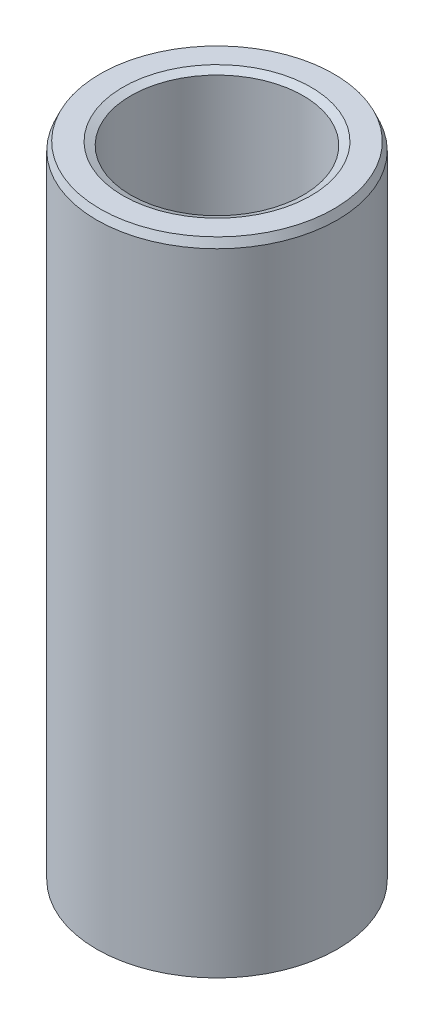
ISO-10303-21;
HEADER;
FILE_DESCRIPTION(('STEP AP214'),'2;1');
FILE_NAME('part.step','',(''),(''),'','','');
FILE_SCHEMA(('AUTOMOTIVE_DESIGN { 1 0 10303 214 1 1 1 1 }'));
ENDSEC;
DATA;
#1=APPLICATION_CONTEXT('core data for automotive mechanical design processes');
#2=APPLICATION_PROTOCOL_DEFINITION('international standard','automotive_design',2000,#1);
#3=PRODUCT_CONTEXT('',#1,'mechanical');
#4=PRODUCT('Part','Part','',(#3));
#5=PRODUCT_RELATED_PRODUCT_CATEGORY('part','',(#4));
#6=PRODUCT_DEFINITION_FORMATION('','',#4);
#7=PRODUCT_DEFINITION_CONTEXT('part definition',#1,'design');
#8=PRODUCT_DEFINITION('design','',#6,#7);
#9=PRODUCT_DEFINITION_SHAPE('','',#8);
#10=(LENGTH_UNIT() NAMED_UNIT(*) SI_UNIT(.MILLI.,.METRE.));
#11=(NAMED_UNIT(*) PLANE_ANGLE_UNIT() SI_UNIT($,.RADIAN.));
#12=(NAMED_UNIT(*) SI_UNIT($,.STERADIAN.) SOLID_ANGLE_UNIT());
#13=UNCERTAINTY_MEASURE_WITH_UNIT(LENGTH_MEASURE(1.E-05),#10,'distance_accuracy_value','');
#14=(GEOMETRIC_REPRESENTATION_CONTEXT(3) GLOBAL_UNCERTAINTY_ASSIGNED_CONTEXT((#13)) GLOBAL_UNIT_ASSIGNED_CONTEXT((#10,
#11,#12)) REPRESENTATION_CONTEXT('',''));
#15=CARTESIAN_POINT('',(0.,0.,0.));
#16=DIRECTION('',(0.,0.,1.));
#17=DIRECTION('',(1.,0.,0.));
#18=AXIS2_PLACEMENT_3D('',#15,#16,#17);
#19=CARTESIAN_POINT('',(0.,293.691769745959,0.));
#20=DIRECTION('',(0.,-1.,0.));
#21=DIRECTION('',(0.,0.,-1.));
#22=AXIS2_PLACEMENT_3D('',#19,#20,#21);
#23=CYLINDRICAL_SURFACE('',#22,55.);
#24=CARTESIAN_POINT('',(0.,1.58074699449356,0.));
#25=DIRECTION('',(0.,1.,0.));
#26=DIRECTION('',(0.,0.,1.));
#27=AXIS2_PLACEMENT_3D('',#24,#25,#26);
#28=CIRCLE('',#27,55.);
#29=CARTESIAN_POINT('',(0.,1.58074699449356,55.));
#30=VERTEX_POINT('',#29);
#31=EDGE_CURVE('E10',#30,#30,#28,.T.);
#32=ORIENTED_EDGE('',*,*,#31,.T.);
#33=EDGE_LOOP('',(#32));
#34=FACE_BOUND('',#33,.T.);
#35=CARTESIAN_POINT('',(0.,290.095074646584,0.));
#36=DIRECTION('',(0.,1.,0.));
#37=DIRECTION('',(0.,0.,1.));
#38=AXIS2_PLACEMENT_3D('',#35,#36,#37);
#39=CIRCLE('',#38,55.);
#40=CARTESIAN_POINT('',(0.,290.095074646584,55.));
#41=VERTEX_POINT('',#40);
#42=EDGE_CURVE('E50',#41,#41,#39,.F.);
#43=ORIENTED_EDGE('',*,*,#42,.T.);
#44=EDGE_LOOP('',(#43));
#45=FACE_BOUND('',#44,.T.);
#46=ADVANCED_FACE('F39',(#34,#45),#23,.T.);
#47=CARTESIAN_POINT('',(0.,293.691769745959,0.));
#48=DIRECTION('',(0.,1.,0.));
#49=DIRECTION('',(0.,0.,1.));
#50=AXIS2_PLACEMENT_3D('',#47,#48,#49);
#51=PLANE('',#50);
#52=CARTESIAN_POINT('',(0.,293.691769745959,0.));
#53=DIRECTION('',(0.,1.,0.));
#54=DIRECTION('',(0.,0.,1.));
#55=AXIS2_PLACEMENT_3D('',#52,#53,#54);
#56=CIRCLE('',#55,42.9624006531695);
#57=CARTESIAN_POINT('',(0.,293.691769745959,42.9624006531695));
#58=VERTEX_POINT('',#57);
#59=EDGE_CURVE('E58',#58,#58,#56,.F.);
#60=ORIENTED_EDGE('',*,*,#59,.T.);
#61=EDGE_LOOP('',(#60));
#62=FACE_BOUND('',#61,.T.);
#63=CARTESIAN_POINT('',(0.,293.691769745959,0.));
#64=DIRECTION('',(0.,1.,0.));
#65=DIRECTION('',(0.,0.,1.));
#66=AXIS2_PLACEMENT_3D('',#63,#64,#65);
#67=CIRCLE('',#66,53.4192530055064);
#68=CARTESIAN_POINT('',(0.,293.691769745959,53.4192530055064));
#69=VERTEX_POINT('',#68);
#70=EDGE_CURVE('E61',#69,#69,#67,.T.);
#71=ORIENTED_EDGE('',*,*,#70,.T.);
#72=EDGE_LOOP('',(#71));
#73=FACE_BOUND('',#72,.T.);
#74=ADVANCED_FACE('F88',(#62,#73),#51,.T.);
#75=CARTESIAN_POINT('',(0.,0.,0.));
#76=DIRECTION('',(0.,1.,0.));
#77=DIRECTION('',(0.,0.,1.));
#78=AXIS2_PLACEMENT_3D('',#75,#76,#77);
#79=PLANE('',#78);
#80=CARTESIAN_POINT('',(0.,0.,0.));
#81=DIRECTION('',(0.,1.,0.));
#82=DIRECTION('',(0.,0.,1.));
#83=AXIS2_PLACEMENT_3D('',#80,#81,#82);
#84=CIRCLE('',#83,40.9464525482886);
#85=CARTESIAN_POINT('',(0.,0.,40.9464525482886));
#86=VERTEX_POINT('',#85);
#87=EDGE_CURVE('E51',#86,#86,#84,.T.);
#88=ORIENTED_EDGE('',*,*,#87,.T.);
#89=EDGE_LOOP('',(#88));
#90=FACE_BOUND('',#89,.T.);
#91=CARTESIAN_POINT('',(0.,0.,0.));
#92=DIRECTION('',(0.,1.,0.));
#93=DIRECTION('',(0.,0.,1.));
#94=AXIS2_PLACEMENT_3D('',#91,#92,#93);
#95=CIRCLE('',#94,51.4033049006256);
#96=CARTESIAN_POINT('',(0.,0.,51.4033049006256));
#97=VERTEX_POINT('',#96);
#98=EDGE_CURVE('E54',#97,#97,#95,.F.);
#99=ORIENTED_EDGE('',*,*,#98,.T.);
#100=EDGE_LOOP('',(#99));
#101=FACE_BOUND('',#100,.T.);
#102=ADVANCED_FACE('F83',(#90,#101),#79,.F.);
#103=CARTESIAN_POINT('',(0.,293.691769745959,0.));
#104=DIRECTION('',(0.,-1.,0.));
#105=DIRECTION('',(0.,0.,-1.));
#106=AXIS2_PLACEMENT_3D('',#103,#104,#105);
#107=CYLINDRICAL_SURFACE('',#106,39.365705553795);
#108=CARTESIAN_POINT('',(0.,292.111022751465,0.));
#109=DIRECTION('',(0.,1.,0.));
#110=DIRECTION('',(0.,0.,1.));
#111=AXIS2_PLACEMENT_3D('',#108,#109,#110);
#112=CIRCLE('',#111,39.365705553795);
#113=CARTESIAN_POINT('',(0.,292.111022751465,39.365705553795));
#114=VERTEX_POINT('',#113);
#115=EDGE_CURVE('E67',#114,#114,#112,.T.);
#116=ORIENTED_EDGE('',*,*,#115,.T.);
#117=EDGE_LOOP('',(#116));
#118=FACE_BOUND('',#117,.T.);
#119=CARTESIAN_POINT('',(0.,3.59669509937455,0.));
#120=DIRECTION('',(0.,1.,0.));
#121=DIRECTION('',(0.,0.,1.));
#122=AXIS2_PLACEMENT_3D('',#119,#120,#121);
#123=CIRCLE('',#122,39.365705553795);
#124=CARTESIAN_POINT('',(0.,3.59669509937455,39.365705553795));
#125=VERTEX_POINT('',#124);
#126=EDGE_CURVE('E69',#125,#125,#123,.F.);
#127=ORIENTED_EDGE('',*,*,#126,.T.);
#128=EDGE_LOOP('',(#127));
#129=FACE_BOUND('',#128,.T.);
#130=ADVANCED_FACE('F71',(#118,#129),#107,.F.);
#131=CARTESIAN_POINT('',(0.,292.111022751465,0.));
#132=DIRECTION('',(0.,1.,0.));
#133=DIRECTION('',(0.,0.,1.));
#134=AXIS2_PLACEMENT_3D('',#131,#132,#133);
#135=CONICAL_SURFACE('',#134,39.365705553795,1.15670854711741);
#136=ORIENTED_EDGE('',*,*,#59,.F.);
#137=EDGE_LOOP('',(#136));
#138=FACE_BOUND('',#137,.T.);
#139=ORIENTED_EDGE('',*,*,#115,.F.);
#140=EDGE_LOOP('',(#139));
#141=FACE_BOUND('',#140,.T.);
#142=ADVANCED_FACE('F77',(#138,#141),#135,.F.);
#143=CARTESIAN_POINT('',(0.,0.,0.));
#144=DIRECTION('',(0.,-1.,0.));
#145=DIRECTION('',(0.,0.,-1.));
#146=AXIS2_PLACEMENT_3D('',#143,#144,#145);
#147=CONICAL_SURFACE('',#146,40.9464525482886,0.414087779677491);
#148=ORIENTED_EDGE('',*,*,#126,.F.);
#149=EDGE_LOOP('',(#148));
#150=FACE_BOUND('',#149,.T.);
#151=ORIENTED_EDGE('',*,*,#87,.F.);
#152=EDGE_LOOP('',(#151));
#153=FACE_BOUND('',#152,.T.);
#154=ADVANCED_FACE('F73',(#150,#153),#147,.F.);
#155=CARTESIAN_POINT('',(0.,1.58074699449356,0.));
#156=DIRECTION('',(0.,1.,0.));
#157=DIRECTION('',(0.,0.,1.));
#158=AXIS2_PLACEMENT_3D('',#155,#156,#157);
#159=CONICAL_SURFACE('',#158,55.,1.1567085471174);
#160=ORIENTED_EDGE('',*,*,#98,.F.);
#161=EDGE_LOOP('',(#160));
#162=FACE_BOUND('',#161,.T.);
#163=ORIENTED_EDGE('',*,*,#31,.F.);
#164=EDGE_LOOP('',(#163));
#165=FACE_BOUND('',#164,.T.);
#166=ADVANCED_FACE('F76',(#162,#165),#159,.T.);
#167=CARTESIAN_POINT('',(0.,293.691769745959,0.));
#168=DIRECTION('',(0.,-1.,0.));
#169=DIRECTION('',(0.,0.,-1.));
#170=AXIS2_PLACEMENT_3D('',#167,#168,#169);
#171=CONICAL_SURFACE('',#170,53.4192530055064,0.414087779677487);
#172=ORIENTED_EDGE('',*,*,#42,.F.);
#173=EDGE_LOOP('',(#172));
#174=FACE_BOUND('',#173,.T.);
#175=ORIENTED_EDGE('',*,*,#70,.F.);
#176=EDGE_LOOP('',(#175));
#177=FACE_BOUND('',#176,.T.);
#178=ADVANCED_FACE('F45',(#174,#177),#171,.T.);
#179=CLOSED_SHELL('',(#46,#74,#102,#130,#142,#154,#166,#178));
#180=MANIFOLD_SOLID_BREP('B2',#179);
#181=ADVANCED_BREP_SHAPE_REPRESENTATION('',(#18,#180),#14);
#182=SHAPE_DEFINITION_REPRESENTATION(#9,#181);
ENDSEC;
END-ISO-10303-21;
